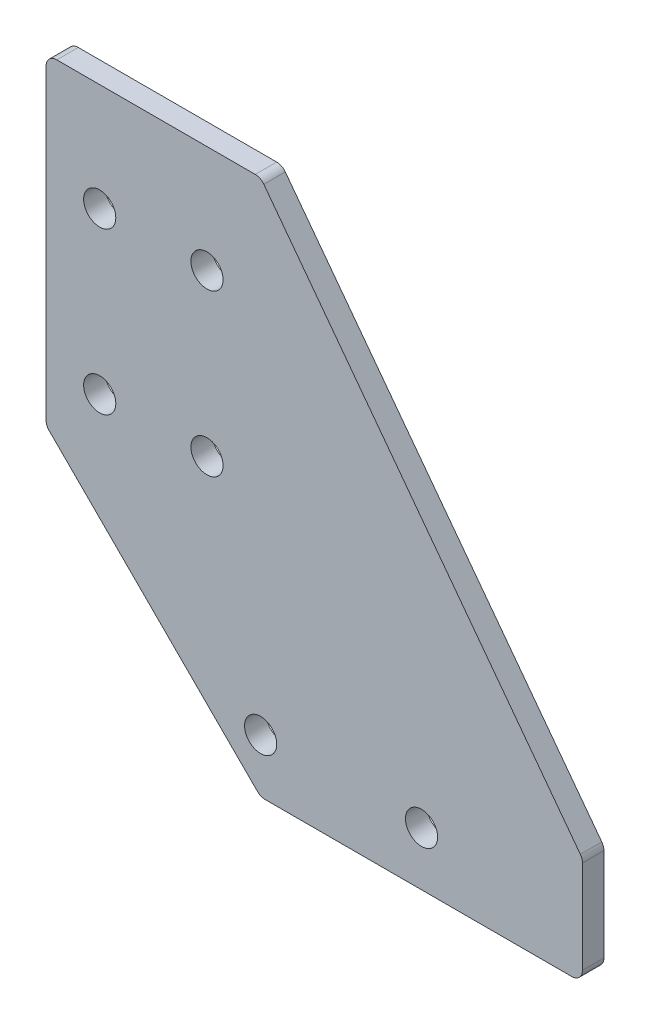
ISO-10303-21;
HEADER;
FILE_DESCRIPTION(('STEP AP214'),'2;1');
FILE_NAME('part.step','',(''),(''),'','','');
FILE_SCHEMA(('AUTOMOTIVE_DESIGN { 1 0 10303 214 1 1 1 1 }'));
ENDSEC;
DATA;
#1=APPLICATION_CONTEXT('core data for automotive mechanical design processes');
#2=APPLICATION_PROTOCOL_DEFINITION('international standard','automotive_design',2000,#1);
#3=PRODUCT_CONTEXT('',#1,'mechanical');
#4=PRODUCT('Part','Part','',(#3));
#5=PRODUCT_RELATED_PRODUCT_CATEGORY('part','',(#4));
#6=PRODUCT_DEFINITION_FORMATION('','',#4);
#7=PRODUCT_DEFINITION_CONTEXT('part definition',#1,'design');
#8=PRODUCT_DEFINITION('design','',#6,#7);
#9=PRODUCT_DEFINITION_SHAPE('','',#8);
#10=(LENGTH_UNIT() NAMED_UNIT(*) SI_UNIT(.MILLI.,.METRE.));
#11=(NAMED_UNIT(*) PLANE_ANGLE_UNIT() SI_UNIT($,.RADIAN.));
#12=(NAMED_UNIT(*) SI_UNIT($,.STERADIAN.) SOLID_ANGLE_UNIT());
#13=UNCERTAINTY_MEASURE_WITH_UNIT(LENGTH_MEASURE(1.E-05),#10,'distance_accuracy_value','');
#14=(GEOMETRIC_REPRESENTATION_CONTEXT(3) GLOBAL_UNCERTAINTY_ASSIGNED_CONTEXT((#13)) GLOBAL_UNIT_ASSIGNED_CONTEXT((#10,
#11,#12)) REPRESENTATION_CONTEXT('',''));
#15=CARTESIAN_POINT('',(0.,0.,0.));
#16=DIRECTION('',(0.,0.,1.));
#17=DIRECTION('',(1.,0.,0.));
#18=AXIS2_PLACEMENT_3D('',#15,#16,#17);
#19=CARTESIAN_POINT('',(0.,0.,2.));
#20=DIRECTION('',(0.,0.,-1.));
#21=DIRECTION('',(-1.,0.,0.));
#22=AXIS2_PLACEMENT_3D('',#19,#20,#21);
#23=PLANE('',#22);
#24=DIRECTION('',(0.,1.,0.));
#25=VECTOR('',#24,1.);
#26=CARTESIAN_POINT('',(44.999999999999,5.,2.));
#27=LINE('',#26,#25);
#28=CARTESIAN_POINT('',(44.999999999999,-4.,2.));
#29=VERTEX_POINT('',#28);
#30=CARTESIAN_POINT('',(44.999999999999,4.66666666666667,2.));
#31=VERTEX_POINT('',#30);
#32=EDGE_CURVE('E236',#29,#31,#27,.T.);
#33=ORIENTED_EDGE('',*,*,#32,.T.);
#34=CARTESIAN_POINT('',(43.999999999999,4.66666666666667,2.));
#35=DIRECTION('',(0.,0.,-1.));
#36=DIRECTION('',(-1.,0.,0.));
#37=AXIS2_PLACEMENT_3D('',#34,#35,#36);
#38=CIRCLE('',#37,1.);
#39=CARTESIAN_POINT('',(44.799999999999,5.26666666666667,2.));
#40=VERTEX_POINT('',#39);
#41=EDGE_CURVE('E186',#31,#40,#38,.F.);
#42=ORIENTED_EDGE('',*,*,#41,.T.);
#43=DIRECTION('',(-0.6,0.8,0.));
#44=VECTOR('',#43,1.);
#45=CARTESIAN_POINT('',(14.999999999999,45.,2.));
#46=LINE('',#45,#44);
#47=CARTESIAN_POINT('',(15.299999999999,44.6,2.));
#48=VERTEX_POINT('',#47);
#49=EDGE_CURVE('E148',#40,#48,#46,.T.);
#50=ORIENTED_EDGE('',*,*,#49,.T.);
#51=CARTESIAN_POINT('',(14.499999999999,44.,2.));
#52=DIRECTION('',(0.,0.,-1.));
#53=DIRECTION('',(-1.,0.,0.));
#54=AXIS2_PLACEMENT_3D('',#51,#52,#53);
#55=CIRCLE('',#54,1.);
#56=CARTESIAN_POINT('',(14.499999999999,45.,2.));
#57=VERTEX_POINT('',#56);
#58=EDGE_CURVE('E60',#48,#57,#55,.F.);
#59=ORIENTED_EDGE('',*,*,#58,.T.);
#60=DIRECTION('',(-1.,0.,0.));
#61=VECTOR('',#60,1.);
#62=CARTESIAN_POINT('',(-5.000000000001,45.,2.));
#63=LINE('',#62,#61);
#64=CARTESIAN_POINT('',(-4.000000000001,45.,2.));
#65=VERTEX_POINT('',#64);
#66=EDGE_CURVE('E165',#57,#65,#63,.T.);
#67=ORIENTED_EDGE('',*,*,#66,.T.);
#68=CARTESIAN_POINT('',(-4.000000000001,44.,2.));
#69=DIRECTION('',(0.,0.,-1.));
#70=DIRECTION('',(-1.,0.,0.));
#71=AXIS2_PLACEMENT_3D('',#68,#69,#70);
#72=CIRCLE('',#71,1.);
#73=CARTESIAN_POINT('',(-5.000000000001,44.,2.));
#74=VERTEX_POINT('',#73);
#75=EDGE_CURVE('E177',#65,#74,#72,.F.);
#76=ORIENTED_EDGE('',*,*,#75,.T.);
#77=DIRECTION('',(0.,-1.,0.));
#78=VECTOR('',#77,1.);
#79=CARTESIAN_POINT('',(-5.000000000001,15.,2.));
#80=LINE('',#79,#78);
#81=CARTESIAN_POINT('',(-5.000000000001,15.414213562373,2.));
#82=VERTEX_POINT('',#81);
#83=EDGE_CURVE('E159',#74,#82,#80,.T.);
#84=ORIENTED_EDGE('',*,*,#83,.T.);
#85=CARTESIAN_POINT('',(-4.000000000001,15.414213562373,2.));
#86=DIRECTION('',(0.,0.,-1.));
#87=DIRECTION('',(-1.,0.,0.));
#88=AXIS2_PLACEMENT_3D('',#85,#86,#87);
#89=CIRCLE('',#88,1.);
#90=CARTESIAN_POINT('',(-4.70710678118756,14.7071067811865,2.));
#91=VERTEX_POINT('',#90);
#92=EDGE_CURVE('E180',#82,#91,#89,.F.);
#93=ORIENTED_EDGE('',*,*,#92,.T.);
#94=DIRECTION('',(0.707106781186543,-0.707106781186552,0.));
#95=VECTOR('',#94,1.);
#96=CARTESIAN_POINT('',(14.9999999999987,-5.,2.));
#97=LINE('',#96,#95);
#98=CARTESIAN_POINT('',(14.7071067811852,-4.70710678118655,2.));
#99=VERTEX_POINT('',#98);
#100=EDGE_CURVE('E218',#91,#99,#97,.T.);
#101=ORIENTED_EDGE('',*,*,#100,.T.);
#102=CARTESIAN_POINT('',(15.4142135623718,-4.,2.));
#103=DIRECTION('',(0.,0.,-1.));
#104=DIRECTION('',(-1.,0.,0.));
#105=AXIS2_PLACEMENT_3D('',#102,#103,#104);
#106=CIRCLE('',#105,1.);
#107=CARTESIAN_POINT('',(15.4142135623718,-5.,2.));
#108=VERTEX_POINT('',#107);
#109=EDGE_CURVE('E182',#99,#108,#106,.F.);
#110=ORIENTED_EDGE('',*,*,#109,.T.);
#111=DIRECTION('',(1.,0.,0.));
#112=VECTOR('',#111,1.);
#113=CARTESIAN_POINT('',(44.999999999999,-5.,2.));
#114=LINE('',#113,#112);
#115=CARTESIAN_POINT('',(43.999999999999,-5.,2.));
#116=VERTEX_POINT('',#115);
#117=EDGE_CURVE('E238',#108,#116,#114,.T.);
#118=ORIENTED_EDGE('',*,*,#117,.T.);
#119=CARTESIAN_POINT('',(43.999999999999,-4.,2.));
#120=DIRECTION('',(0.,0.,-1.));
#121=DIRECTION('',(-1.,0.,0.));
#122=AXIS2_PLACEMENT_3D('',#119,#120,#121);
#123=CIRCLE('',#122,1.);
#124=EDGE_CURVE('E184',#116,#29,#123,.F.);
#125=ORIENTED_EDGE('',*,*,#124,.T.);
#126=EDGE_LOOP('',(#33,#42,#50,#59,#67,#76,#84,#93,#101,#110,#118,#125));
#127=FACE_BOUND('',#126,.T.);
#128=CARTESIAN_POINT('',(0.,35.,2.));
#129=DIRECTION('',(0.,0.,1.));
#130=DIRECTION('',(1.,0.,0.));
#131=AXIS2_PLACEMENT_3D('',#128,#129,#130);
#132=CIRCLE('',#131,1.50000000000002);
#133=CARTESIAN_POINT('',(1.50000000000002,35.,2.));
#134=VERTEX_POINT('',#133);
#135=EDGE_CURVE('E231',#134,#134,#132,.T.);
#136=ORIENTED_EDGE('',*,*,#135,.F.);
#137=EDGE_LOOP('',(#136));
#138=FACE_BOUND('',#137,.T.);
#139=CARTESIAN_POINT('',(29.999999999999,0.,2.));
#140=DIRECTION('',(0.,0.,1.));
#141=DIRECTION('',(1.,0.,0.));
#142=AXIS2_PLACEMENT_3D('',#139,#140,#141);
#143=CIRCLE('',#142,1.50000000000003);
#144=CARTESIAN_POINT('',(31.4999999999991,0.,2.));
#145=VERTEX_POINT('',#144);
#146=EDGE_CURVE('E245',#145,#145,#143,.T.);
#147=ORIENTED_EDGE('',*,*,#146,.F.);
#148=EDGE_LOOP('',(#147));
#149=FACE_BOUND('',#148,.T.);
#150=CARTESIAN_POINT('',(0.,20.,2.));
#151=DIRECTION('',(0.,0.,1.));
#152=DIRECTION('',(1.,0.,0.));
#153=AXIS2_PLACEMENT_3D('',#150,#151,#152);
#154=CIRCLE('',#153,1.50000000000002);
#155=CARTESIAN_POINT('',(1.50000000000002,20.,2.));
#156=VERTEX_POINT('',#155);
#157=EDGE_CURVE('E251',#156,#156,#154,.T.);
#158=ORIENTED_EDGE('',*,*,#157,.F.);
#159=EDGE_LOOP('',(#158));
#160=FACE_BOUND('',#159,.T.);
#161=CARTESIAN_POINT('',(14.999999999999,0.,2.));
#162=DIRECTION('',(0.,0.,1.));
#163=DIRECTION('',(1.,0.,0.));
#164=AXIS2_PLACEMENT_3D('',#161,#162,#163);
#165=CIRCLE('',#164,1.50000000000003);
#166=CARTESIAN_POINT('',(16.499999999999,0.,2.));
#167=VERTEX_POINT('',#166);
#168=EDGE_CURVE('E257',#167,#167,#165,.T.);
#169=ORIENTED_EDGE('',*,*,#168,.F.);
#170=EDGE_LOOP('',(#169));
#171=FACE_BOUND('',#170,.T.);
#172=CARTESIAN_POINT('',(10.000000000001,35.,2.));
#173=DIRECTION('',(0.,0.,1.));
#174=DIRECTION('',(1.,0.,0.));
#175=AXIS2_PLACEMENT_3D('',#172,#173,#174);
#176=CIRCLE('',#175,1.50000000000002);
#177=CARTESIAN_POINT('',(11.500000000001,35.,2.));
#178=VERTEX_POINT('',#177);
#179=EDGE_CURVE('E263',#178,#178,#176,.T.);
#180=ORIENTED_EDGE('',*,*,#179,.F.);
#181=EDGE_LOOP('',(#180));
#182=FACE_BOUND('',#181,.T.);
#183=CARTESIAN_POINT('',(10.000000000001,20.,2.));
#184=DIRECTION('',(0.,0.,1.));
#185=DIRECTION('',(1.,0.,0.));
#186=AXIS2_PLACEMENT_3D('',#183,#184,#185);
#187=CIRCLE('',#186,1.50000000000002);
#188=CARTESIAN_POINT('',(11.500000000001,20.,2.));
#189=VERTEX_POINT('',#188);
#190=EDGE_CURVE('E269',#189,#189,#187,.T.);
#191=ORIENTED_EDGE('',*,*,#190,.F.);
#192=EDGE_LOOP('',(#191));
#193=FACE_BOUND('',#192,.T.);
#194=ADVANCED_FACE('F39',(#127,#138,#149,#160,#171,#182,#193),#23,.F.);
#195=CARTESIAN_POINT('',(0.,0.,0.));
#196=DIRECTION('',(0.,0.,-1.));
#197=DIRECTION('',(-1.,0.,0.));
#198=AXIS2_PLACEMENT_3D('',#195,#196,#197);
#199=PLANE('',#198);
#200=CARTESIAN_POINT('',(10.000000000001,35.,0.));
#201=DIRECTION('',(0.,0.,1.));
#202=DIRECTION('',(1.,0.,0.));
#203=AXIS2_PLACEMENT_3D('',#200,#201,#202);
#204=CIRCLE('',#203,1.50000000000002);
#205=CARTESIAN_POINT('',(11.500000000001,35.,0.));
#206=VERTEX_POINT('',#205);
#207=EDGE_CURVE('E266',#206,#206,#204,.T.);
#208=ORIENTED_EDGE('',*,*,#207,.T.);
#209=EDGE_LOOP('',(#208));
#210=FACE_BOUND('',#209,.T.);
#211=CARTESIAN_POINT('',(0.,20.,0.));
#212=DIRECTION('',(0.,0.,1.));
#213=DIRECTION('',(1.,0.,0.));
#214=AXIS2_PLACEMENT_3D('',#211,#212,#213);
#215=CIRCLE('',#214,1.50000000000002);
#216=CARTESIAN_POINT('',(1.50000000000002,20.,0.));
#217=VERTEX_POINT('',#216);
#218=EDGE_CURVE('E254',#217,#217,#215,.T.);
#219=ORIENTED_EDGE('',*,*,#218,.T.);
#220=EDGE_LOOP('',(#219));
#221=FACE_BOUND('',#220,.T.);
#222=CARTESIAN_POINT('',(0.,35.,0.));
#223=DIRECTION('',(0.,0.,1.));
#224=DIRECTION('',(1.,0.,0.));
#225=AXIS2_PLACEMENT_3D('',#222,#223,#224);
#226=CIRCLE('',#225,1.50000000000002);
#227=CARTESIAN_POINT('',(1.50000000000002,35.,0.));
#228=VERTEX_POINT('',#227);
#229=EDGE_CURVE('E242',#228,#228,#226,.T.);
#230=ORIENTED_EDGE('',*,*,#229,.T.);
#231=EDGE_LOOP('',(#230));
#232=FACE_BOUND('',#231,.T.);
#233=DIRECTION('',(-0.6,0.8,0.));
#234=VECTOR('',#233,1.);
#235=CARTESIAN_POINT('',(14.999999999999,45.,0.));
#236=LINE('',#235,#234);
#237=CARTESIAN_POINT('',(44.799999999999,5.26666666666667,0.));
#238=VERTEX_POINT('',#237);
#239=CARTESIAN_POINT('',(15.299999999999,44.6,0.));
#240=VERTEX_POINT('',#239);
#241=EDGE_CURVE('E146',#238,#240,#236,.T.);
#242=ORIENTED_EDGE('',*,*,#241,.F.);
#243=CARTESIAN_POINT('',(43.999999999999,4.66666666666667,0.));
#244=DIRECTION('',(0.,0.,-1.));
#245=DIRECTION('',(-1.,0.,0.));
#246=AXIS2_PLACEMENT_3D('',#243,#244,#245);
#247=CIRCLE('',#246,1.);
#248=CARTESIAN_POINT('',(44.999999999999,4.66666666666667,0.));
#249=VERTEX_POINT('',#248);
#250=EDGE_CURVE('E129',#238,#249,#247,.T.);
#251=ORIENTED_EDGE('',*,*,#250,.T.);
#252=DIRECTION('',(0.,1.,0.));
#253=VECTOR('',#252,1.);
#254=CARTESIAN_POINT('',(44.999999999999,5.,0.));
#255=LINE('',#254,#253);
#256=CARTESIAN_POINT('',(44.999999999999,-4.,0.));
#257=VERTEX_POINT('',#256);
#258=EDGE_CURVE('E157',#257,#249,#255,.T.);
#259=ORIENTED_EDGE('',*,*,#258,.F.);
#260=CARTESIAN_POINT('',(43.999999999999,-4.,0.));
#261=DIRECTION('',(0.,0.,-1.));
#262=DIRECTION('',(-1.,0.,0.));
#263=AXIS2_PLACEMENT_3D('',#260,#261,#262);
#264=CIRCLE('',#263,1.);
#265=CARTESIAN_POINT('',(43.999999999999,-5.,0.));
#266=VERTEX_POINT('',#265);
#267=EDGE_CURVE('E140',#257,#266,#264,.T.);
#268=ORIENTED_EDGE('',*,*,#267,.T.);
#269=DIRECTION('',(1.,0.,0.));
#270=VECTOR('',#269,1.);
#271=CARTESIAN_POINT('',(44.999999999999,-5.,0.));
#272=LINE('',#271,#270);
#273=CARTESIAN_POINT('',(15.4142135623718,-5.,0.));
#274=VERTEX_POINT('',#273);
#275=EDGE_CURVE('E161',#274,#266,#272,.T.);
#276=ORIENTED_EDGE('',*,*,#275,.F.);
#277=CARTESIAN_POINT('',(15.4142135623718,-4.,0.));
#278=DIRECTION('',(0.,0.,-1.));
#279=DIRECTION('',(-1.,0.,0.));
#280=AXIS2_PLACEMENT_3D('',#277,#278,#279);
#281=CIRCLE('',#280,1.);
#282=CARTESIAN_POINT('',(14.7071067811852,-4.70710678118655,0.));
#283=VERTEX_POINT('',#282);
#284=EDGE_CURVE('E171',#274,#283,#281,.T.);
#285=ORIENTED_EDGE('',*,*,#284,.T.);
#286=DIRECTION('',(0.707106781186543,-0.707106781186552,0.));
#287=VECTOR('',#286,1.);
#288=CARTESIAN_POINT('',(14.9999999999987,-5.,0.));
#289=LINE('',#288,#287);
#290=CARTESIAN_POINT('',(-4.70710678118756,14.7071067811865,0.));
#291=VERTEX_POINT('',#290);
#292=EDGE_CURVE('E226',#291,#283,#289,.T.);
#293=ORIENTED_EDGE('',*,*,#292,.F.);
#294=CARTESIAN_POINT('',(-4.000000000001,15.414213562373,0.));
#295=DIRECTION('',(0.,0.,-1.));
#296=DIRECTION('',(-1.,0.,0.));
#297=AXIS2_PLACEMENT_3D('',#294,#295,#296);
#298=CIRCLE('',#297,1.);
#299=CARTESIAN_POINT('',(-5.000000000001,15.414213562373,0.));
#300=VERTEX_POINT('',#299);
#301=EDGE_CURVE('E169',#291,#300,#298,.T.);
#302=ORIENTED_EDGE('',*,*,#301,.T.);
#303=DIRECTION('',(0.,-1.,0.));
#304=VECTOR('',#303,1.);
#305=CARTESIAN_POINT('',(-5.000000000001,15.,0.));
#306=LINE('',#305,#304);
#307=CARTESIAN_POINT('',(-5.000000000001,44.,0.));
#308=VERTEX_POINT('',#307);
#309=EDGE_CURVE('E210',#308,#300,#306,.T.);
#310=ORIENTED_EDGE('',*,*,#309,.F.);
#311=CARTESIAN_POINT('',(-4.000000000001,44.,0.));
#312=DIRECTION('',(0.,0.,-1.));
#313=DIRECTION('',(-1.,0.,0.));
#314=AXIS2_PLACEMENT_3D('',#311,#312,#313);
#315=CIRCLE('',#314,1.);
#316=CARTESIAN_POINT('',(-4.000000000001,45.,0.));
#317=VERTEX_POINT('',#316);
#318=EDGE_CURVE('E149',#308,#317,#315,.T.);
#319=ORIENTED_EDGE('',*,*,#318,.T.);
#320=DIRECTION('',(-1.,0.,0.));
#321=VECTOR('',#320,1.);
#322=CARTESIAN_POINT('',(-5.000000000001,45.,0.));
#323=LINE('',#322,#321);
#324=CARTESIAN_POINT('',(14.499999999999,45.,0.));
#325=VERTEX_POINT('',#324);
#326=EDGE_CURVE('E156',#325,#317,#323,.T.);
#327=ORIENTED_EDGE('',*,*,#326,.F.);
#328=CARTESIAN_POINT('',(14.499999999999,44.,0.));
#329=DIRECTION('',(0.,0.,-1.));
#330=DIRECTION('',(-1.,0.,0.));
#331=AXIS2_PLACEMENT_3D('',#328,#329,#330);
#332=CIRCLE('',#331,1.);
#333=EDGE_CURVE('E155',#325,#240,#332,.T.);
#334=ORIENTED_EDGE('',*,*,#333,.T.);
#335=EDGE_LOOP('',(#242,#251,#259,#268,#276,#285,#293,#302,#310,#319,#327,#334));
#336=FACE_BOUND('',#335,.T.);
#337=CARTESIAN_POINT('',(29.999999999999,0.,0.));
#338=DIRECTION('',(0.,0.,1.));
#339=DIRECTION('',(1.,0.,0.));
#340=AXIS2_PLACEMENT_3D('',#337,#338,#339);
#341=CIRCLE('',#340,1.50000000000003);
#342=CARTESIAN_POINT('',(31.4999999999991,0.,0.));
#343=VERTEX_POINT('',#342);
#344=EDGE_CURVE('E248',#343,#343,#341,.T.);
#345=ORIENTED_EDGE('',*,*,#344,.T.);
#346=EDGE_LOOP('',(#345));
#347=FACE_BOUND('',#346,.T.);
#348=CARTESIAN_POINT('',(14.999999999999,0.,0.));
#349=DIRECTION('',(0.,0.,1.));
#350=DIRECTION('',(1.,0.,0.));
#351=AXIS2_PLACEMENT_3D('',#348,#349,#350);
#352=CIRCLE('',#351,1.50000000000003);
#353=CARTESIAN_POINT('',(16.499999999999,0.,0.));
#354=VERTEX_POINT('',#353);
#355=EDGE_CURVE('E260',#354,#354,#352,.T.);
#356=ORIENTED_EDGE('',*,*,#355,.T.);
#357=EDGE_LOOP('',(#356));
#358=FACE_BOUND('',#357,.T.);
#359=CARTESIAN_POINT('',(10.000000000001,20.,0.));
#360=DIRECTION('',(0.,0.,1.));
#361=DIRECTION('',(1.,0.,0.));
#362=AXIS2_PLACEMENT_3D('',#359,#360,#361);
#363=CIRCLE('',#362,1.50000000000002);
#364=CARTESIAN_POINT('',(11.500000000001,20.,0.));
#365=VERTEX_POINT('',#364);
#366=EDGE_CURVE('E272',#365,#365,#363,.T.);
#367=ORIENTED_EDGE('',*,*,#366,.T.);
#368=EDGE_LOOP('',(#367));
#369=FACE_BOUND('',#368,.T.);
#370=ADVANCED_FACE('F152',(#210,#221,#232,#336,#347,#358,#369),#199,.T.);
#371=CARTESIAN_POINT('',(-5.000000000001,15.,2.));
#372=DIRECTION('',(1.,0.,0.));
#373=DIRECTION('',(0.,0.,-1.));
#374=AXIS2_PLACEMENT_3D('',#371,#372,#373);
#375=PLANE('',#374);
#376=ORIENTED_EDGE('',*,*,#309,.T.);
#377=DIRECTION('',(0.,0.,-1.));
#378=VECTOR('',#377,1.);
#379=CARTESIAN_POINT('',(-5.000000000001,15.414213562373,2.));
#380=LINE('',#379,#378);
#381=EDGE_CURVE('E201',#300,#82,#380,.F.);
#382=ORIENTED_EDGE('',*,*,#381,.T.);
#383=ORIENTED_EDGE('',*,*,#83,.F.);
#384=DIRECTION('',(0.,0.,-1.));
#385=VECTOR('',#384,1.);
#386=CARTESIAN_POINT('',(-5.000000000001,44.,2.));
#387=LINE('',#386,#385);
#388=EDGE_CURVE('E198',#74,#308,#387,.T.);
#389=ORIENTED_EDGE('',*,*,#388,.T.);
#390=EDGE_LOOP('',(#376,#382,#383,#389));
#391=FACE_BOUND('',#390,.T.);
#392=ADVANCED_FACE('F207',(#391),#375,.F.);
#393=CARTESIAN_POINT('',(14.9999999999987,-5.,2.));
#394=DIRECTION('',(0.707106781186552,0.707106781186543,0.));
#395=DIRECTION('',(-0.707106781186543,0.707106781186552,0.));
#396=AXIS2_PLACEMENT_3D('',#393,#394,#395);
#397=PLANE('',#396);
#398=ORIENTED_EDGE('',*,*,#292,.T.);
#399=DIRECTION('',(0.,0.,-1.));
#400=VECTOR('',#399,1.);
#401=CARTESIAN_POINT('',(14.7071067811852,-4.70710678118655,2.));
#402=LINE('',#401,#400);
#403=EDGE_CURVE('E196',#283,#99,#402,.F.);
#404=ORIENTED_EDGE('',*,*,#403,.T.);
#405=ORIENTED_EDGE('',*,*,#100,.F.);
#406=DIRECTION('',(0.,0.,-1.));
#407=VECTOR('',#406,1.);
#408=CARTESIAN_POINT('',(-4.70710678118755,14.7071067811865,2.));
#409=LINE('',#408,#407);
#410=EDGE_CURVE('E193',#91,#291,#409,.T.);
#411=ORIENTED_EDGE('',*,*,#410,.T.);
#412=EDGE_LOOP('',(#398,#404,#405,#411));
#413=FACE_BOUND('',#412,.T.);
#414=ADVANCED_FACE('F225',(#413),#397,.F.);
#415=CARTESIAN_POINT('',(44.999999999999,-5.,2.));
#416=DIRECTION('',(0.,1.,0.));
#417=DIRECTION('',(0.,0.,1.));
#418=AXIS2_PLACEMENT_3D('',#415,#416,#417);
#419=PLANE('',#418);
#420=ORIENTED_EDGE('',*,*,#275,.T.);
#421=DIRECTION('',(0.,0.,-1.));
#422=VECTOR('',#421,1.);
#423=CARTESIAN_POINT('',(43.999999999999,-5.,2.));
#424=LINE('',#423,#422);
#425=EDGE_CURVE('E191',#266,#116,#424,.F.);
#426=ORIENTED_EDGE('',*,*,#425,.T.);
#427=ORIENTED_EDGE('',*,*,#117,.F.);
#428=DIRECTION('',(0.,0.,-1.));
#429=VECTOR('',#428,1.);
#430=CARTESIAN_POINT('',(15.4142135623718,-5.,2.));
#431=LINE('',#430,#429);
#432=EDGE_CURVE('E188',#108,#274,#431,.T.);
#433=ORIENTED_EDGE('',*,*,#432,.T.);
#434=EDGE_LOOP('',(#420,#426,#427,#433));
#435=FACE_BOUND('',#434,.T.);
#436=ADVANCED_FACE('F301',(#435),#419,.F.);
#437=CARTESIAN_POINT('',(44.999999999999,5.,2.));
#438=DIRECTION('',(-1.,0.,0.));
#439=DIRECTION('',(0.,0.,1.));
#440=AXIS2_PLACEMENT_3D('',#437,#438,#439);
#441=PLANE('',#440);
#442=ORIENTED_EDGE('',*,*,#258,.T.);
#443=DIRECTION('',(0.,0.,-1.));
#444=VECTOR('',#443,1.);
#445=CARTESIAN_POINT('',(44.999999999999,4.66666666666667,2.));
#446=LINE('',#445,#444);
#447=EDGE_CURVE('E134',#249,#31,#446,.F.);
#448=ORIENTED_EDGE('',*,*,#447,.T.);
#449=ORIENTED_EDGE('',*,*,#32,.F.);
#450=DIRECTION('',(0.,0.,-1.));
#451=VECTOR('',#450,1.);
#452=CARTESIAN_POINT('',(44.999999999999,-4.,2.));
#453=LINE('',#452,#451);
#454=EDGE_CURVE('E139',#29,#257,#453,.T.);
#455=ORIENTED_EDGE('',*,*,#454,.T.);
#456=EDGE_LOOP('',(#442,#448,#449,#455));
#457=FACE_BOUND('',#456,.T.);
#458=ADVANCED_FACE('F298',(#457),#441,.F.);
#459=CARTESIAN_POINT('',(14.999999999999,45.,2.));
#460=DIRECTION('',(-0.8,-0.6,0.));
#461=DIRECTION('',(0.6,-0.8,0.));
#462=AXIS2_PLACEMENT_3D('',#459,#460,#461);
#463=PLANE('',#462);
#464=ORIENTED_EDGE('',*,*,#49,.F.);
#465=DIRECTION('',(0.,0.,-1.));
#466=VECTOR('',#465,1.);
#467=CARTESIAN_POINT('',(44.799999999999,5.26666666666667,2.));
#468=LINE('',#467,#466);
#469=EDGE_CURVE('E133',#40,#238,#468,.T.);
#470=ORIENTED_EDGE('',*,*,#469,.T.);
#471=ORIENTED_EDGE('',*,*,#241,.T.);
#472=DIRECTION('',(0.,0.,-1.));
#473=VECTOR('',#472,1.);
#474=CARTESIAN_POINT('',(15.299999999999,44.6,2.));
#475=LINE('',#474,#473);
#476=EDGE_CURVE('E150',#240,#48,#475,.F.);
#477=ORIENTED_EDGE('',*,*,#476,.T.);
#478=EDGE_LOOP('',(#464,#470,#471,#477));
#479=FACE_BOUND('',#478,.T.);
#480=ADVANCED_FACE('F145',(#479),#463,.F.);
#481=CARTESIAN_POINT('',(-5.000000000001,45.,2.));
#482=DIRECTION('',(0.,-1.,0.));
#483=DIRECTION('',(0.,0.,-1.));
#484=AXIS2_PLACEMENT_3D('',#481,#482,#483);
#485=PLANE('',#484);
#486=ORIENTED_EDGE('',*,*,#66,.F.);
#487=DIRECTION('',(0.,0.,-1.));
#488=VECTOR('',#487,1.);
#489=CARTESIAN_POINT('',(14.499999999999,45.,2.));
#490=LINE('',#489,#488);
#491=EDGE_CURVE('E11',#57,#325,#490,.T.);
#492=ORIENTED_EDGE('',*,*,#491,.T.);
#493=ORIENTED_EDGE('',*,*,#326,.T.);
#494=DIRECTION('',(0.,0.,-1.));
#495=VECTOR('',#494,1.);
#496=CARTESIAN_POINT('',(-4.000000000001,45.,2.));
#497=LINE('',#496,#495);
#498=EDGE_CURVE('E47',#317,#65,#497,.F.);
#499=ORIENTED_EDGE('',*,*,#498,.T.);
#500=EDGE_LOOP('',(#486,#492,#493,#499));
#501=FACE_BOUND('',#500,.T.);
#502=ADVANCED_FACE('F293',(#501),#485,.F.);
#503=CARTESIAN_POINT('',(0.,35.,2.));
#504=DIRECTION('',(0.,0.,-1.));
#505=DIRECTION('',(-1.,0.,0.));
#506=AXIS2_PLACEMENT_3D('',#503,#504,#505);
#507=CYLINDRICAL_SURFACE('',#506,1.50000000000002);
#508=ORIENTED_EDGE('',*,*,#135,.T.);
#509=EDGE_LOOP('',(#508));
#510=FACE_BOUND('',#509,.T.);
#511=ORIENTED_EDGE('',*,*,#229,.F.);
#512=EDGE_LOOP('',(#511));
#513=FACE_BOUND('',#512,.T.);
#514=ADVANCED_FACE('F290',(#510,#513),#507,.F.);
#515=CARTESIAN_POINT('',(29.999999999999,0.,2.));
#516=DIRECTION('',(0.,0.,-1.));
#517=DIRECTION('',(-1.,0.,0.));
#518=AXIS2_PLACEMENT_3D('',#515,#516,#517);
#519=CYLINDRICAL_SURFACE('',#518,1.50000000000003);
#520=ORIENTED_EDGE('',*,*,#146,.T.);
#521=EDGE_LOOP('',(#520));
#522=FACE_BOUND('',#521,.T.);
#523=ORIENTED_EDGE('',*,*,#344,.F.);
#524=EDGE_LOOP('',(#523));
#525=FACE_BOUND('',#524,.T.);
#526=ADVANCED_FACE('F445',(#522,#525),#519,.F.);
#527=CARTESIAN_POINT('',(0.,20.,2.));
#528=DIRECTION('',(0.,0.,-1.));
#529=DIRECTION('',(-1.,0.,0.));
#530=AXIS2_PLACEMENT_3D('',#527,#528,#529);
#531=CYLINDRICAL_SURFACE('',#530,1.50000000000002);
#532=ORIENTED_EDGE('',*,*,#157,.T.);
#533=EDGE_LOOP('',(#532));
#534=FACE_BOUND('',#533,.T.);
#535=ORIENTED_EDGE('',*,*,#218,.F.);
#536=EDGE_LOOP('',(#535));
#537=FACE_BOUND('',#536,.T.);
#538=ADVANCED_FACE('F454',(#534,#537),#531,.F.);
#539=CARTESIAN_POINT('',(14.999999999999,0.,2.));
#540=DIRECTION('',(0.,0.,-1.));
#541=DIRECTION('',(-1.,0.,0.));
#542=AXIS2_PLACEMENT_3D('',#539,#540,#541);
#543=CYLINDRICAL_SURFACE('',#542,1.50000000000003);
#544=ORIENTED_EDGE('',*,*,#168,.T.);
#545=EDGE_LOOP('',(#544));
#546=FACE_BOUND('',#545,.T.);
#547=ORIENTED_EDGE('',*,*,#355,.F.);
#548=EDGE_LOOP('',(#547));
#549=FACE_BOUND('',#548,.T.);
#550=ADVANCED_FACE('F463',(#546,#549),#543,.F.);
#551=CARTESIAN_POINT('',(10.000000000001,35.,2.));
#552=DIRECTION('',(0.,0.,-1.));
#553=DIRECTION('',(-1.,0.,0.));
#554=AXIS2_PLACEMENT_3D('',#551,#552,#553);
#555=CYLINDRICAL_SURFACE('',#554,1.50000000000002);
#556=ORIENTED_EDGE('',*,*,#179,.T.);
#557=EDGE_LOOP('',(#556));
#558=FACE_BOUND('',#557,.T.);
#559=ORIENTED_EDGE('',*,*,#207,.F.);
#560=EDGE_LOOP('',(#559));
#561=FACE_BOUND('',#560,.T.);
#562=ADVANCED_FACE('F473',(#558,#561),#555,.F.);
#563=CARTESIAN_POINT('',(10.000000000001,20.,2.));
#564=DIRECTION('',(0.,0.,-1.));
#565=DIRECTION('',(-1.,0.,0.));
#566=AXIS2_PLACEMENT_3D('',#563,#564,#565);
#567=CYLINDRICAL_SURFACE('',#566,1.50000000000002);
#568=ORIENTED_EDGE('',*,*,#190,.T.);
#569=EDGE_LOOP('',(#568));
#570=FACE_BOUND('',#569,.T.);
#571=ORIENTED_EDGE('',*,*,#366,.F.);
#572=EDGE_LOOP('',(#571));
#573=FACE_BOUND('',#572,.T.);
#574=ADVANCED_FACE('F278',(#570,#573),#567,.F.);
#575=CARTESIAN_POINT('',(43.999999999999,4.66666666666667,2.));
#576=DIRECTION('',(0.,0.,-1.));
#577=DIRECTION('',(-1.,0.,0.));
#578=AXIS2_PLACEMENT_3D('',#575,#576,#577);
#579=CYLINDRICAL_SURFACE('',#578,1.);
#580=ORIENTED_EDGE('',*,*,#41,.F.);
#581=ORIENTED_EDGE('',*,*,#447,.F.);
#582=ORIENTED_EDGE('',*,*,#250,.F.);
#583=ORIENTED_EDGE('',*,*,#469,.F.);
#584=EDGE_LOOP('',(#580,#581,#582,#583));
#585=FACE_BOUND('',#584,.T.);
#586=ADVANCED_FACE('F132',(#585),#579,.T.);
#587=CARTESIAN_POINT('',(43.999999999999,-4.,2.));
#588=DIRECTION('',(0.,0.,-1.));
#589=DIRECTION('',(-1.,0.,0.));
#590=AXIS2_PLACEMENT_3D('',#587,#588,#589);
#591=CYLINDRICAL_SURFACE('',#590,1.);
#592=ORIENTED_EDGE('',*,*,#124,.F.);
#593=ORIENTED_EDGE('',*,*,#425,.F.);
#594=ORIENTED_EDGE('',*,*,#267,.F.);
#595=ORIENTED_EDGE('',*,*,#454,.F.);
#596=EDGE_LOOP('',(#592,#593,#594,#595));
#597=FACE_BOUND('',#596,.T.);
#598=ADVANCED_FACE('F312',(#597),#591,.T.);
#599=CARTESIAN_POINT('',(15.4142135623718,-4.,2.));
#600=DIRECTION('',(0.,0.,-1.));
#601=DIRECTION('',(-1.,0.,0.));
#602=AXIS2_PLACEMENT_3D('',#599,#600,#601);
#603=CYLINDRICAL_SURFACE('',#602,1.);
#604=ORIENTED_EDGE('',*,*,#109,.F.);
#605=ORIENTED_EDGE('',*,*,#403,.F.);
#606=ORIENTED_EDGE('',*,*,#284,.F.);
#607=ORIENTED_EDGE('',*,*,#432,.F.);
#608=EDGE_LOOP('',(#604,#605,#606,#607));
#609=FACE_BOUND('',#608,.T.);
#610=ADVANCED_FACE('F315',(#609),#603,.T.);
#611=CARTESIAN_POINT('',(-4.000000000001,15.414213562373,2.));
#612=DIRECTION('',(0.,0.,-1.));
#613=DIRECTION('',(-1.,0.,0.));
#614=AXIS2_PLACEMENT_3D('',#611,#612,#613);
#615=CYLINDRICAL_SURFACE('',#614,1.);
#616=ORIENTED_EDGE('',*,*,#92,.F.);
#617=ORIENTED_EDGE('',*,*,#381,.F.);
#618=ORIENTED_EDGE('',*,*,#301,.F.);
#619=ORIENTED_EDGE('',*,*,#410,.F.);
#620=EDGE_LOOP('',(#616,#617,#618,#619));
#621=FACE_BOUND('',#620,.T.);
#622=ADVANCED_FACE('F221',(#621),#615,.T.);
#623=CARTESIAN_POINT('',(14.499999999999,44.,2.));
#624=DIRECTION('',(0.,0.,-1.));
#625=DIRECTION('',(-1.,0.,0.));
#626=AXIS2_PLACEMENT_3D('',#623,#624,#625);
#627=CYLINDRICAL_SURFACE('',#626,1.);
#628=ORIENTED_EDGE('',*,*,#58,.F.);
#629=ORIENTED_EDGE('',*,*,#476,.F.);
#630=ORIENTED_EDGE('',*,*,#333,.F.);
#631=ORIENTED_EDGE('',*,*,#491,.F.);
#632=EDGE_LOOP('',(#628,#629,#630,#631));
#633=FACE_BOUND('',#632,.T.);
#634=ADVANCED_FACE('F321',(#633),#627,.T.);
#635=CARTESIAN_POINT('',(-4.000000000001,44.,2.));
#636=DIRECTION('',(0.,0.,-1.));
#637=DIRECTION('',(-1.,0.,0.));
#638=AXIS2_PLACEMENT_3D('',#635,#636,#637);
#639=CYLINDRICAL_SURFACE('',#638,1.);
#640=ORIENTED_EDGE('',*,*,#75,.F.);
#641=ORIENTED_EDGE('',*,*,#498,.F.);
#642=ORIENTED_EDGE('',*,*,#318,.F.);
#643=ORIENTED_EDGE('',*,*,#388,.F.);
#644=EDGE_LOOP('',(#640,#641,#642,#643));
#645=FACE_BOUND('',#644,.T.);
#646=ADVANCED_FACE('F41',(#645),#639,.T.);
#647=CLOSED_SHELL('',(#194,#370,#392,#414,#436,#458,#480,#502,#514,#526,#538,#550,#562,#574,
#586,#598,#610,#622,#634,#646));
#648=MANIFOLD_SOLID_BREP('B2',#647);
#649=ADVANCED_BREP_SHAPE_REPRESENTATION('',(#18,#648),#14);
#650=SHAPE_DEFINITION_REPRESENTATION(#9,#649);
ENDSEC;
END-ISO-10303-21;
